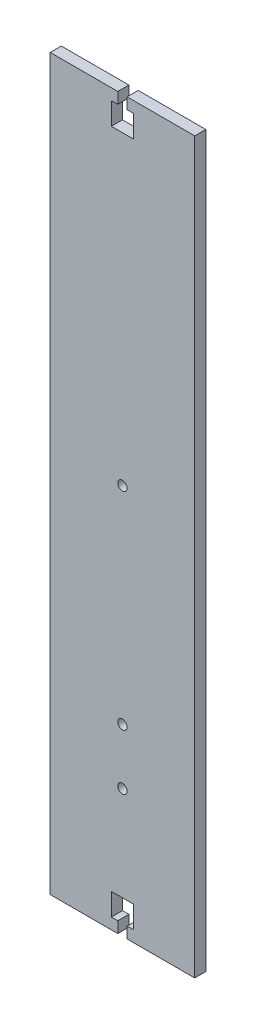
ISO-10303-21;
HEADER;
FILE_DESCRIPTION(('STEP AP214'),'2;1');
FILE_NAME('part.step','',(''),(''),'','','');
FILE_SCHEMA(('AUTOMOTIVE_DESIGN { 1 0 10303 214 1 1 1 1 }'));
ENDSEC;
DATA;
#1=APPLICATION_CONTEXT('core data for automotive mechanical design processes');
#2=APPLICATION_PROTOCOL_DEFINITION('international standard','automotive_design',2000,#1);
#3=PRODUCT_CONTEXT('',#1,'mechanical');
#4=PRODUCT('Part','Part','',(#3));
#5=PRODUCT_RELATED_PRODUCT_CATEGORY('part','',(#4));
#6=PRODUCT_DEFINITION_FORMATION('','',#4);
#7=PRODUCT_DEFINITION_CONTEXT('part definition',#1,'design');
#8=PRODUCT_DEFINITION('design','',#6,#7);
#9=PRODUCT_DEFINITION_SHAPE('','',#8);
#10=(LENGTH_UNIT() NAMED_UNIT(*) SI_UNIT(.MILLI.,.METRE.));
#11=(NAMED_UNIT(*) PLANE_ANGLE_UNIT() SI_UNIT($,.RADIAN.));
#12=(NAMED_UNIT(*) SI_UNIT($,.STERADIAN.) SOLID_ANGLE_UNIT());
#13=UNCERTAINTY_MEASURE_WITH_UNIT(LENGTH_MEASURE(1.E-05),#10,'distance_accuracy_value','');
#14=(GEOMETRIC_REPRESENTATION_CONTEXT(3) GLOBAL_UNCERTAINTY_ASSIGNED_CONTEXT((#13)) GLOBAL_UNIT_ASSIGNED_CONTEXT((#10,
#11,#12)) REPRESENTATION_CONTEXT('',''));
#15=CARTESIAN_POINT('',(0.,0.,0.));
#16=DIRECTION('',(0.,0.,1.));
#17=DIRECTION('',(1.,0.,0.));
#18=AXIS2_PLACEMENT_3D('',#15,#16,#17);
#19=CARTESIAN_POINT('',(32.498,-164.,5.));
#20=DIRECTION('',(0.,1.,0.));
#21=DIRECTION('',(0.,0.,1.));
#22=AXIS2_PLACEMENT_3D('',#19,#20,#21);
#23=PLANE('',#22);
#24=DIRECTION('',(1.,0.,0.));
#25=VECTOR('',#24,1.);
#26=CARTESIAN_POINT('',(32.498,-164.,0.));
#27=LINE('',#26,#25);
#28=CARTESIAN_POINT('',(-32.498,-164.,0.));
#29=VERTEX_POINT('',#28);
#30=CARTESIAN_POINT('',(-2.10000000000068,-164.,0.));
#31=VERTEX_POINT('',#30);
#32=EDGE_CURVE('E283',#29,#31,#27,.T.);
#33=ORIENTED_EDGE('',*,*,#32,.T.);
#34=DIRECTION('',(0.,0.,1.));
#35=VECTOR('',#34,1.);
#36=CARTESIAN_POINT('',(-2.10000000000068,-164.,-5.));
#37=LINE('',#36,#35);
#38=CARTESIAN_POINT('',(-2.10000000000068,-164.,5.));
#39=VERTEX_POINT('',#38);
#40=EDGE_CURVE('E192',#31,#39,#37,.T.);
#41=ORIENTED_EDGE('',*,*,#40,.T.);
#42=DIRECTION('',(1.,0.,0.));
#43=VECTOR('',#42,1.);
#44=CARTESIAN_POINT('',(32.498,-164.,5.));
#45=LINE('',#44,#43);
#46=CARTESIAN_POINT('',(-32.498,-164.,5.));
#47=VERTEX_POINT('',#46);
#48=EDGE_CURVE('E270',#47,#39,#45,.T.);
#49=ORIENTED_EDGE('',*,*,#48,.F.);
#50=DIRECTION('',(0.,0.,-1.));
#51=VECTOR('',#50,1.);
#52=CARTESIAN_POINT('',(-32.498,-164.,5.));
#53=LINE('',#52,#51);
#54=EDGE_CURVE('E299',#47,#29,#53,.T.);
#55=ORIENTED_EDGE('',*,*,#54,.T.);
#56=EDGE_LOOP('',(#33,#41,#49,#55));
#57=FACE_BOUND('',#56,.T.);
#58=ADVANCED_FACE('F37',(#57),#23,.F.);
#59=CARTESIAN_POINT('',(32.498,164.,5.));
#60=DIRECTION('',(0.,-1.,0.));
#61=DIRECTION('',(1.,0.,0.));
#62=AXIS2_PLACEMENT_3D('',#59,#60,#61);
#63=PLANE('',#62);
#64=DIRECTION('',(-1.,0.,0.));
#65=VECTOR('',#64,1.);
#66=CARTESIAN_POINT('',(32.498,164.,5.));
#67=LINE('',#66,#65);
#68=CARTESIAN_POINT('',(-2.09999999999999,164.,5.));
#69=VERTEX_POINT('',#68);
#70=CARTESIAN_POINT('',(-32.498,164.,5.));
#71=VERTEX_POINT('',#70);
#72=EDGE_CURVE('E275',#69,#71,#67,.T.);
#73=ORIENTED_EDGE('',*,*,#72,.F.);
#74=DIRECTION('',(0.,0.,1.));
#75=VECTOR('',#74,1.);
#76=CARTESIAN_POINT('',(-2.09999999999999,164.,-5.));
#77=LINE('',#76,#75);
#78=CARTESIAN_POINT('',(-2.09999999999999,164.,0.));
#79=VERTEX_POINT('',#78);
#80=EDGE_CURVE('E221',#79,#69,#77,.T.);
#81=ORIENTED_EDGE('',*,*,#80,.F.);
#82=DIRECTION('',(-1.,0.,0.));
#83=VECTOR('',#82,1.);
#84=CARTESIAN_POINT('',(32.498,164.,0.));
#85=LINE('',#84,#83);
#86=CARTESIAN_POINT('',(-32.498,164.,0.));
#87=VERTEX_POINT('',#86);
#88=EDGE_CURVE('E288',#79,#87,#85,.T.);
#89=ORIENTED_EDGE('',*,*,#88,.T.);
#90=DIRECTION('',(0.,0.,-1.));
#91=VECTOR('',#90,1.);
#92=CARTESIAN_POINT('',(-32.498,164.,5.));
#93=LINE('',#92,#91);
#94=EDGE_CURVE('E278',#71,#87,#93,.T.);
#95=ORIENTED_EDGE('',*,*,#94,.F.);
#96=EDGE_LOOP('',(#73,#81,#89,#95));
#97=FACE_BOUND('',#96,.T.);
#98=ADVANCED_FACE('F404',(#97),#63,.F.);
#99=CARTESIAN_POINT('',(-32.498,-164.,5.));
#100=DIRECTION('',(1.,0.,0.));
#101=DIRECTION('',(0.,0.,-1.));
#102=AXIS2_PLACEMENT_3D('',#99,#100,#101);
#103=PLANE('',#102);
#104=DIRECTION('',(0.,-1.,0.));
#105=VECTOR('',#104,1.);
#106=CARTESIAN_POINT('',(-32.498,-164.,0.));
#107=LINE('',#106,#105);
#108=EDGE_CURVE('E279',#87,#29,#107,.T.);
#109=ORIENTED_EDGE('',*,*,#108,.T.);
#110=ORIENTED_EDGE('',*,*,#54,.F.);
#111=DIRECTION('',(0.,-1.,0.));
#112=VECTOR('',#111,1.);
#113=CARTESIAN_POINT('',(-32.498,-164.,5.));
#114=LINE('',#113,#112);
#115=EDGE_CURVE('E265',#71,#47,#114,.T.);
#116=ORIENTED_EDGE('',*,*,#115,.F.);
#117=ORIENTED_EDGE('',*,*,#94,.T.);
#118=EDGE_LOOP('',(#109,#110,#116,#117));
#119=FACE_BOUND('',#118,.T.);
#120=ADVANCED_FACE('F39',(#119),#103,.F.);
#121=CARTESIAN_POINT('',(2.09999999999929,-164.,5.));
#122=VERTEX_POINT('',#121);
#123=CARTESIAN_POINT('',(32.498,-164.,5.));
#124=VERTEX_POINT('',#123);
#125=EDGE_CURVE('E268',#122,#124,#45,.T.);
#126=ORIENTED_EDGE('',*,*,#125,.F.);
#127=DIRECTION('',(0.,0.,1.));
#128=VECTOR('',#127,1.);
#129=CARTESIAN_POINT('',(2.09999999999929,-164.,-5.));
#130=LINE('',#129,#128);
#131=CARTESIAN_POINT('',(2.09999999999929,-164.,0.));
#132=VERTEX_POINT('',#131);
#133=EDGE_CURVE('E247',#132,#122,#130,.T.);
#134=ORIENTED_EDGE('',*,*,#133,.F.);
#135=CARTESIAN_POINT('',(32.498,-164.,0.));
#136=VERTEX_POINT('',#135);
#137=EDGE_CURVE('E282',#132,#136,#27,.T.);
#138=ORIENTED_EDGE('',*,*,#137,.T.);
#139=DIRECTION('',(0.,0.,-1.));
#140=VECTOR('',#139,1.);
#141=CARTESIAN_POINT('',(32.498,-164.,5.));
#142=LINE('',#141,#140);
#143=EDGE_CURVE('E296',#124,#136,#142,.T.);
#144=ORIENTED_EDGE('',*,*,#143,.F.);
#145=EDGE_LOOP('',(#126,#134,#138,#144));
#146=FACE_BOUND('',#145,.T.);
#147=ADVANCED_FACE('F371',(#146),#23,.F.);
#148=CARTESIAN_POINT('',(32.498,-164.,5.));
#149=DIRECTION('',(-1.,0.,0.));
#150=DIRECTION('',(0.,-1.,0.));
#151=AXIS2_PLACEMENT_3D('',#148,#149,#150);
#152=PLANE('',#151);
#153=DIRECTION('',(0.,1.,0.));
#154=VECTOR('',#153,1.);
#155=CARTESIAN_POINT('',(32.498,-164.,0.));
#156=LINE('',#155,#154);
#157=CARTESIAN_POINT('',(32.498,164.,0.));
#158=VERTEX_POINT('',#157);
#159=EDGE_CURVE('E286',#136,#158,#156,.T.);
#160=ORIENTED_EDGE('',*,*,#159,.T.);
#161=DIRECTION('',(0.,0.,-1.));
#162=VECTOR('',#161,1.);
#163=CARTESIAN_POINT('',(32.498,164.,5.));
#164=LINE('',#163,#162);
#165=CARTESIAN_POINT('',(32.498,164.,5.));
#166=VERTEX_POINT('',#165);
#167=EDGE_CURVE('E293',#166,#158,#164,.T.);
#168=ORIENTED_EDGE('',*,*,#167,.F.);
#169=DIRECTION('',(0.,1.,0.));
#170=VECTOR('',#169,1.);
#171=CARTESIAN_POINT('',(32.498,-164.,5.));
#172=LINE('',#171,#170);
#173=EDGE_CURVE('E273',#124,#166,#172,.T.);
#174=ORIENTED_EDGE('',*,*,#173,.F.);
#175=ORIENTED_EDGE('',*,*,#143,.T.);
#176=EDGE_LOOP('',(#160,#168,#174,#175));
#177=FACE_BOUND('',#176,.T.);
#178=ADVANCED_FACE('F365',(#177),#152,.F.);
#179=CARTESIAN_POINT('',(2.1,164.,0.));
#180=VERTEX_POINT('',#179);
#181=EDGE_CURVE('E269',#158,#180,#85,.T.);
#182=ORIENTED_EDGE('',*,*,#181,.T.);
#183=DIRECTION('',(0.,0.,1.));
#184=VECTOR('',#183,1.);
#185=CARTESIAN_POINT('',(2.1,164.,-5.));
#186=LINE('',#185,#184);
#187=CARTESIAN_POINT('',(2.1,164.,5.));
#188=VERTEX_POINT('',#187);
#189=EDGE_CURVE('E223',#180,#188,#186,.T.);
#190=ORIENTED_EDGE('',*,*,#189,.T.);
#191=EDGE_CURVE('E276',#166,#188,#67,.T.);
#192=ORIENTED_EDGE('',*,*,#191,.F.);
#193=ORIENTED_EDGE('',*,*,#167,.T.);
#194=EDGE_LOOP('',(#182,#190,#192,#193));
#195=FACE_BOUND('',#194,.T.);
#196=ADVANCED_FACE('F360',(#195),#63,.F.);
#197=CARTESIAN_POINT('',(0.,0.,5.));
#198=DIRECTION('',(0.,0.,1.));
#199=DIRECTION('',(1.,0.,0.));
#200=AXIS2_PLACEMENT_3D('',#197,#198,#199);
#201=PLANE('',#200);
#202=CARTESIAN_POINT('',(0.,11.5000000000002,5.));
#203=DIRECTION('',(0.,0.,1.));
#204=DIRECTION('',(1.,0.,0.));
#205=AXIS2_PLACEMENT_3D('',#202,#203,#204);
#206=CIRCLE('',#205,2.1);
#207=CARTESIAN_POINT('',(2.10000000000001,11.5000000000002,5.));
#208=VERTEX_POINT('',#207);
#209=EDGE_CURVE('E604',#208,#208,#206,.T.);
#210=ORIENTED_EDGE('',*,*,#209,.F.);
#211=EDGE_LOOP('',(#210));
#212=FACE_BOUND('',#211,.T.);
#213=CARTESIAN_POINT('',(0.,-106.5,5.));
#214=DIRECTION('',(0.,0.,1.));
#215=DIRECTION('',(1.,0.,0.));
#216=AXIS2_PLACEMENT_3D('',#213,#214,#215);
#217=CIRCLE('',#216,2.1);
#218=CARTESIAN_POINT('',(2.1,-106.5,5.));
#219=VERTEX_POINT('',#218);
#220=EDGE_CURVE('E600',#219,#219,#217,.T.);
#221=ORIENTED_EDGE('',*,*,#220,.F.);
#222=EDGE_LOOP('',(#221));
#223=FACE_BOUND('',#222,.T.);
#224=DIRECTION('',(0.,-1.,0.));
#225=VECTOR('',#224,1.);
#226=CARTESIAN_POINT('',(-2.09999999999999,164.,5.));
#227=LINE('',#226,#225);
#228=CARTESIAN_POINT('',(-2.09999999999999,159.,5.));
#229=VERTEX_POINT('',#228);
#230=EDGE_CURVE('E200',#69,#229,#227,.T.);
#231=ORIENTED_EDGE('',*,*,#230,.F.);
#232=ORIENTED_EDGE('',*,*,#72,.T.);
#233=ORIENTED_EDGE('',*,*,#115,.T.);
#234=ORIENTED_EDGE('',*,*,#48,.T.);
#235=DIRECTION('',(0.,-1.,0.));
#236=VECTOR('',#235,1.);
#237=CARTESIAN_POINT('',(-2.10000000000068,-164.,5.));
#238=LINE('',#237,#236);
#239=CARTESIAN_POINT('',(-2.10000000000066,-159.,5.));
#240=VERTEX_POINT('',#239);
#241=EDGE_CURVE('E245',#240,#39,#238,.T.);
#242=ORIENTED_EDGE('',*,*,#241,.F.);
#243=DIRECTION('',(1.,0.,0.));
#244=VECTOR('',#243,1.);
#245=CARTESIAN_POINT('',(-2.10000000000066,-159.,5.));
#246=LINE('',#245,#244);
#247=CARTESIAN_POINT('',(-5.00000000000066,-159.,5.));
#248=VERTEX_POINT('',#247);
#249=EDGE_CURVE('E242',#248,#240,#246,.T.);
#250=ORIENTED_EDGE('',*,*,#249,.F.);
#251=DIRECTION('',(0.,-1.,0.));
#252=VECTOR('',#251,1.);
#253=CARTESIAN_POINT('',(-5.00000000000066,-159.,5.));
#254=LINE('',#253,#252);
#255=CARTESIAN_POINT('',(-5.00000000000063,-149.,5.));
#256=VERTEX_POINT('',#255);
#257=EDGE_CURVE('E239',#256,#248,#254,.T.);
#258=ORIENTED_EDGE('',*,*,#257,.F.);
#259=DIRECTION('',(-1.,0.,0.));
#260=VECTOR('',#259,1.);
#261=CARTESIAN_POINT('',(4.99999999999935,-149.,5.));
#262=LINE('',#261,#260);
#263=CARTESIAN_POINT('',(4.99999999999935,-149.,5.));
#264=VERTEX_POINT('',#263);
#265=EDGE_CURVE('E236',#264,#256,#262,.T.);
#266=ORIENTED_EDGE('',*,*,#265,.F.);
#267=DIRECTION('',(0.,1.,0.));
#268=VECTOR('',#267,1.);
#269=CARTESIAN_POINT('',(4.99999999999931,-159.,5.));
#270=LINE('',#269,#268);
#271=CARTESIAN_POINT('',(4.99999999999931,-159.,5.));
#272=VERTEX_POINT('',#271);
#273=EDGE_CURVE('E233',#272,#264,#270,.T.);
#274=ORIENTED_EDGE('',*,*,#273,.F.);
#275=DIRECTION('',(1.,0.,0.));
#276=VECTOR('',#275,1.);
#277=CARTESIAN_POINT('',(2.09999999999931,-159.,5.));
#278=LINE('',#277,#276);
#279=CARTESIAN_POINT('',(2.09999999999931,-159.,5.));
#280=VERTEX_POINT('',#279);
#281=EDGE_CURVE('E229',#280,#272,#278,.T.);
#282=ORIENTED_EDGE('',*,*,#281,.F.);
#283=DIRECTION('',(0.,1.,0.));
#284=VECTOR('',#283,1.);
#285=CARTESIAN_POINT('',(2.09999999999929,-164.,5.));
#286=LINE('',#285,#284);
#287=EDGE_CURVE('E227',#122,#280,#286,.T.);
#288=ORIENTED_EDGE('',*,*,#287,.F.);
#289=ORIENTED_EDGE('',*,*,#125,.T.);
#290=ORIENTED_EDGE('',*,*,#173,.T.);
#291=ORIENTED_EDGE('',*,*,#191,.T.);
#292=DIRECTION('',(0.,1.,0.));
#293=VECTOR('',#292,1.);
#294=CARTESIAN_POINT('',(2.1,164.,5.));
#295=LINE('',#294,#293);
#296=CARTESIAN_POINT('',(2.1,159.,5.));
#297=VERTEX_POINT('',#296);
#298=EDGE_CURVE('E198',#297,#188,#295,.T.);
#299=ORIENTED_EDGE('',*,*,#298,.F.);
#300=DIRECTION('',(-1.,0.,0.));
#301=VECTOR('',#300,1.);
#302=CARTESIAN_POINT('',(2.1,159.,5.));
#303=LINE('',#302,#301);
#304=CARTESIAN_POINT('',(5.,159.,5.));
#305=VERTEX_POINT('',#304);
#306=EDGE_CURVE('E176',#305,#297,#303,.T.);
#307=ORIENTED_EDGE('',*,*,#306,.F.);
#308=DIRECTION('',(0.,1.,0.));
#309=VECTOR('',#308,1.);
#310=CARTESIAN_POINT('',(5.,159.,5.));
#311=LINE('',#310,#309);
#312=CARTESIAN_POINT('',(5.,149.,5.));
#313=VERTEX_POINT('',#312);
#314=EDGE_CURVE('E185',#313,#305,#311,.T.);
#315=ORIENTED_EDGE('',*,*,#314,.F.);
#316=DIRECTION('',(1.,0.,0.));
#317=VECTOR('',#316,1.);
#318=CARTESIAN_POINT('',(5.,149.,5.));
#319=LINE('',#318,#317);
#320=CARTESIAN_POINT('',(-5.,149.,5.));
#321=VERTEX_POINT('',#320);
#322=EDGE_CURVE('E182',#321,#313,#319,.T.);
#323=ORIENTED_EDGE('',*,*,#322,.F.);
#324=DIRECTION('',(0.,-1.,0.));
#325=VECTOR('',#324,1.);
#326=CARTESIAN_POINT('',(-4.99999999999999,159.,5.));
#327=LINE('',#326,#325);
#328=CARTESIAN_POINT('',(-4.99999999999999,159.,5.));
#329=VERTEX_POINT('',#328);
#330=EDGE_CURVE('E209',#329,#321,#327,.T.);
#331=ORIENTED_EDGE('',*,*,#330,.F.);
#332=DIRECTION('',(-1.,0.,0.));
#333=VECTOR('',#332,1.);
#334=CARTESIAN_POINT('',(-2.09999999999999,159.,5.));
#335=LINE('',#334,#333);
#336=EDGE_CURVE('E206',#229,#329,#335,.T.);
#337=ORIENTED_EDGE('',*,*,#336,.F.);
#338=EDGE_LOOP('',(#231,#232,#233,#234,#242,#250,#258,#266,#274,#282,#288,#289,#290,#291,#299,
#307,#315,#323,#331,#337));
#339=FACE_BOUND('',#338,.T.);
#340=CARTESIAN_POINT('',(0.,-81.4999999999999,5.));
#341=DIRECTION('',(0.,0.,1.));
#342=DIRECTION('',(1.,0.,0.));
#343=AXIS2_PLACEMENT_3D('',#340,#341,#342);
#344=CIRCLE('',#343,2.1);
#345=CARTESIAN_POINT('',(2.10000000000001,-81.4999999999999,5.));
#346=VERTEX_POINT('',#345);
#347=EDGE_CURVE('E214',#346,#346,#344,.T.);
#348=ORIENTED_EDGE('',*,*,#347,.F.);
#349=EDGE_LOOP('',(#348));
#350=FACE_BOUND('',#349,.T.);
#351=ADVANCED_FACE('F195',(#212,#223,#339,#350),#201,.T.);
#352=CARTESIAN_POINT('',(0.,0.,0.));
#353=DIRECTION('',(0.,0.,1.));
#354=DIRECTION('',(1.,0.,0.));
#355=AXIS2_PLACEMENT_3D('',#352,#353,#354);
#356=PLANE('',#355);
#357=CARTESIAN_POINT('',(0.,11.5000000000002,0.));
#358=DIRECTION('',(0.,0.,1.));
#359=DIRECTION('',(1.,0.,0.));
#360=AXIS2_PLACEMENT_3D('',#357,#358,#359);
#361=CIRCLE('',#360,2.1);
#362=CARTESIAN_POINT('',(2.10000000000001,11.5000000000002,0.));
#363=VERTEX_POINT('',#362);
#364=EDGE_CURVE('E597',#363,#363,#361,.T.);
#365=ORIENTED_EDGE('',*,*,#364,.T.);
#366=EDGE_LOOP('',(#365));
#367=FACE_BOUND('',#366,.T.);
#368=CARTESIAN_POINT('',(0.,-106.5,0.));
#369=DIRECTION('',(0.,0.,1.));
#370=DIRECTION('',(1.,0.,0.));
#371=AXIS2_PLACEMENT_3D('',#368,#369,#370);
#372=CIRCLE('',#371,2.1);
#373=CARTESIAN_POINT('',(2.1,-106.5,0.));
#374=VERTEX_POINT('',#373);
#375=EDGE_CURVE('E230',#374,#374,#372,.T.);
#376=ORIENTED_EDGE('',*,*,#375,.T.);
#377=EDGE_LOOP('',(#376));
#378=FACE_BOUND('',#377,.T.);
#379=ORIENTED_EDGE('',*,*,#88,.F.);
#380=DIRECTION('',(0.,-1.,0.));
#381=VECTOR('',#380,1.);
#382=CARTESIAN_POINT('',(-2.10000000000009,0.,0.));
#383=LINE('',#382,#381);
#384=CARTESIAN_POINT('',(-2.09999999999999,159.,0.));
#385=VERTEX_POINT('',#384);
#386=EDGE_CURVE('E11',#79,#385,#383,.T.);
#387=ORIENTED_EDGE('',*,*,#386,.T.);
#388=DIRECTION('',(-1.,0.,0.));
#389=VECTOR('',#388,1.);
#390=CARTESIAN_POINT('',(0.,159.,0.));
#391=LINE('',#390,#389);
#392=CARTESIAN_POINT('',(-4.99999999999999,159.,0.));
#393=VERTEX_POINT('',#392);
#394=EDGE_CURVE('E45',#385,#393,#391,.T.);
#395=ORIENTED_EDGE('',*,*,#394,.T.);
#396=DIRECTION('',(0.,-1.,0.));
#397=VECTOR('',#396,1.);
#398=CARTESIAN_POINT('',(-5.00000000000011,0.,0.));
#399=LINE('',#398,#397);
#400=CARTESIAN_POINT('',(-5.,149.,0.));
#401=VERTEX_POINT('',#400);
#402=EDGE_CURVE('E334',#393,#401,#399,.T.);
#403=ORIENTED_EDGE('',*,*,#402,.T.);
#404=DIRECTION('',(1.,0.,0.));
#405=VECTOR('',#404,1.);
#406=CARTESIAN_POINT('',(0.,149.,0.));
#407=LINE('',#406,#405);
#408=CARTESIAN_POINT('',(5.,149.,0.));
#409=VERTEX_POINT('',#408);
#410=EDGE_CURVE('E331',#401,#409,#407,.T.);
#411=ORIENTED_EDGE('',*,*,#410,.T.);
#412=DIRECTION('',(0.,1.,0.));
#413=VECTOR('',#412,1.);
#414=CARTESIAN_POINT('',(5.00000000000001,0.,0.));
#415=LINE('',#414,#413);
#416=CARTESIAN_POINT('',(5.,159.,0.));
#417=VERTEX_POINT('',#416);
#418=EDGE_CURVE('E329',#409,#417,#415,.T.);
#419=ORIENTED_EDGE('',*,*,#418,.T.);
#420=DIRECTION('',(-1.,0.,0.));
#421=VECTOR('',#420,1.);
#422=CARTESIAN_POINT('',(0.,159.,0.));
#423=LINE('',#422,#421);
#424=CARTESIAN_POINT('',(2.1,159.,0.));
#425=VERTEX_POINT('',#424);
#426=EDGE_CURVE('E179',#417,#425,#423,.T.);
#427=ORIENTED_EDGE('',*,*,#426,.T.);
#428=DIRECTION('',(0.,1.,0.));
#429=VECTOR('',#428,1.);
#430=CARTESIAN_POINT('',(2.09999999999999,0.,0.));
#431=LINE('',#430,#429);
#432=EDGE_CURVE('E326',#425,#180,#431,.T.);
#433=ORIENTED_EDGE('',*,*,#432,.T.);
#434=ORIENTED_EDGE('',*,*,#181,.F.);
#435=ORIENTED_EDGE('',*,*,#159,.F.);
#436=ORIENTED_EDGE('',*,*,#137,.F.);
#437=DIRECTION('',(0.,1.,0.));
#438=VECTOR('',#437,1.);
#439=CARTESIAN_POINT('',(2.09999999999973,0.,0.));
#440=LINE('',#439,#438);
#441=CARTESIAN_POINT('',(2.09999999999931,-159.,0.));
#442=VERTEX_POINT('',#441);
#443=EDGE_CURVE('E302',#132,#442,#440,.T.);
#444=ORIENTED_EDGE('',*,*,#443,.T.);
#445=DIRECTION('',(1.,0.,0.));
#446=VECTOR('',#445,1.);
#447=CARTESIAN_POINT('',(0.,-159.,0.));
#448=LINE('',#447,#446);
#449=CARTESIAN_POINT('',(4.99999999999931,-159.,0.));
#450=VERTEX_POINT('',#449);
#451=EDGE_CURVE('E307',#442,#450,#448,.T.);
#452=ORIENTED_EDGE('',*,*,#451,.T.);
#453=DIRECTION('',(0.,1.,0.));
#454=VECTOR('',#453,1.);
#455=CARTESIAN_POINT('',(4.99999999999998,0.,0.));
#456=LINE('',#455,#454);
#457=CARTESIAN_POINT('',(4.99999999999935,-149.,0.));
#458=VERTEX_POINT('',#457);
#459=EDGE_CURVE('E310',#450,#458,#456,.T.);
#460=ORIENTED_EDGE('',*,*,#459,.T.);
#461=DIRECTION('',(-1.,0.,0.));
#462=VECTOR('',#461,1.);
#463=CARTESIAN_POINT('',(-8.27116153345744E-13,-149.,0.));
#464=LINE('',#463,#462);
#465=CARTESIAN_POINT('',(-5.00000000000063,-149.,0.));
#466=VERTEX_POINT('',#465);
#467=EDGE_CURVE('E313',#458,#466,#464,.T.);
#468=ORIENTED_EDGE('',*,*,#467,.T.);
#469=DIRECTION('',(0.,-1.,0.));
#470=VECTOR('',#469,1.);
#471=CARTESIAN_POINT('',(-5.00000000000013,0.,0.));
#472=LINE('',#471,#470);
#473=CARTESIAN_POINT('',(-5.00000000000066,-159.,0.));
#474=VERTEX_POINT('',#473);
#475=EDGE_CURVE('E316',#466,#474,#472,.T.);
#476=ORIENTED_EDGE('',*,*,#475,.T.);
#477=DIRECTION('',(1.,0.,0.));
#478=VECTOR('',#477,1.);
#479=CARTESIAN_POINT('',(0.,-159.,0.));
#480=LINE('',#479,#478);
#481=CARTESIAN_POINT('',(-2.10000000000066,-159.,0.));
#482=VERTEX_POINT('',#481);
#483=EDGE_CURVE('E319',#474,#482,#480,.T.);
#484=ORIENTED_EDGE('',*,*,#483,.T.);
#485=DIRECTION('',(0.,-1.,0.));
#486=VECTOR('',#485,1.);
#487=CARTESIAN_POINT('',(-2.1000000000001,0.,0.));
#488=LINE('',#487,#486);
#489=EDGE_CURVE('E322',#482,#31,#488,.T.);
#490=ORIENTED_EDGE('',*,*,#489,.T.);
#491=ORIENTED_EDGE('',*,*,#32,.F.);
#492=ORIENTED_EDGE('',*,*,#108,.F.);
#493=EDGE_LOOP('',(#379,#387,#395,#403,#411,#419,#427,#433,#434,#435,#436,#444,#452,#460,#468,
#476,#484,#490,#491,#492));
#494=FACE_BOUND('',#493,.T.);
#495=CARTESIAN_POINT('',(0.,-81.4999999999999,0.));
#496=DIRECTION('',(0.,0.,1.));
#497=DIRECTION('',(1.,0.,0.));
#498=AXIS2_PLACEMENT_3D('',#495,#496,#497);
#499=CIRCLE('',#498,2.1);
#500=CARTESIAN_POINT('',(2.10000000000001,-81.4999999999999,0.));
#501=VERTEX_POINT('',#500);
#502=EDGE_CURVE('E264',#501,#501,#499,.T.);
#503=ORIENTED_EDGE('',*,*,#502,.T.);
#504=EDGE_LOOP('',(#503));
#505=FACE_BOUND('',#504,.T.);
#506=ADVANCED_FACE('F339',(#367,#378,#494,#505),#356,.F.);
#507=CARTESIAN_POINT('',(0.,-81.4999999999999,-5.));
#508=DIRECTION('',(0.,0.,1.));
#509=DIRECTION('',(1.,0.,0.));
#510=AXIS2_PLACEMENT_3D('',#507,#508,#509);
#511=CYLINDRICAL_SURFACE('',#510,2.1);
#512=ORIENTED_EDGE('',*,*,#347,.T.);
#513=EDGE_LOOP('',(#512));
#514=FACE_BOUND('',#513,.T.);
#515=ORIENTED_EDGE('',*,*,#502,.F.);
#516=EDGE_LOOP('',(#515));
#517=FACE_BOUND('',#516,.T.);
#518=ADVANCED_FACE('F442',(#514,#517),#511,.F.);
#519=CARTESIAN_POINT('',(-2.10000000000068,-164.,-5.));
#520=DIRECTION('',(-1.,0.,0.));
#521=DIRECTION('',(0.,-1.,0.));
#522=AXIS2_PLACEMENT_3D('',#519,#520,#521);
#523=PLANE('',#522);
#524=DIRECTION('',(0.,0.,1.));
#525=VECTOR('',#524,1.);
#526=CARTESIAN_POINT('',(-2.10000000000066,-159.,-5.));
#527=LINE('',#526,#525);
#528=EDGE_CURVE('E250',#482,#240,#527,.T.);
#529=ORIENTED_EDGE('',*,*,#528,.T.);
#530=ORIENTED_EDGE('',*,*,#241,.T.);
#531=ORIENTED_EDGE('',*,*,#40,.F.);
#532=ORIENTED_EDGE('',*,*,#489,.F.);
#533=EDGE_LOOP('',(#529,#530,#531,#532));
#534=FACE_BOUND('',#533,.T.);
#535=ADVANCED_FACE('F396',(#534),#523,.F.);
#536=CARTESIAN_POINT('',(-2.10000000000066,-159.,-5.));
#537=DIRECTION('',(0.,-1.,0.));
#538=DIRECTION('',(0.,0.,-1.));
#539=AXIS2_PLACEMENT_3D('',#536,#537,#538);
#540=PLANE('',#539);
#541=DIRECTION('',(0.,0.,1.));
#542=VECTOR('',#541,1.);
#543=CARTESIAN_POINT('',(-5.00000000000066,-159.,-5.));
#544=LINE('',#543,#542);
#545=EDGE_CURVE('E252',#474,#248,#544,.T.);
#546=ORIENTED_EDGE('',*,*,#545,.T.);
#547=ORIENTED_EDGE('',*,*,#249,.T.);
#548=ORIENTED_EDGE('',*,*,#528,.F.);
#549=ORIENTED_EDGE('',*,*,#483,.F.);
#550=EDGE_LOOP('',(#546,#547,#548,#549));
#551=FACE_BOUND('',#550,.T.);
#552=ADVANCED_FACE('F393',(#551),#540,.F.);
#553=CARTESIAN_POINT('',(-5.00000000000066,-159.,-5.));
#554=DIRECTION('',(-1.,0.,0.));
#555=DIRECTION('',(0.,-1.,0.));
#556=AXIS2_PLACEMENT_3D('',#553,#554,#555);
#557=PLANE('',#556);
#558=DIRECTION('',(0.,0.,1.));
#559=VECTOR('',#558,1.);
#560=CARTESIAN_POINT('',(-5.00000000000063,-149.,-5.));
#561=LINE('',#560,#559);
#562=EDGE_CURVE('E254',#466,#256,#561,.T.);
#563=ORIENTED_EDGE('',*,*,#562,.T.);
#564=ORIENTED_EDGE('',*,*,#257,.T.);
#565=ORIENTED_EDGE('',*,*,#545,.F.);
#566=ORIENTED_EDGE('',*,*,#475,.F.);
#567=EDGE_LOOP('',(#563,#564,#565,#566));
#568=FACE_BOUND('',#567,.T.);
#569=ADVANCED_FACE('F388',(#568),#557,.F.);
#570=CARTESIAN_POINT('',(4.99999999999935,-149.,-5.));
#571=DIRECTION('',(0.,1.,0.));
#572=DIRECTION('',(-1.,0.,0.));
#573=AXIS2_PLACEMENT_3D('',#570,#571,#572);
#574=PLANE('',#573);
#575=DIRECTION('',(0.,0.,1.));
#576=VECTOR('',#575,1.);
#577=CARTESIAN_POINT('',(4.99999999999935,-149.,-5.));
#578=LINE('',#577,#576);
#579=EDGE_CURVE('E256',#458,#264,#578,.T.);
#580=ORIENTED_EDGE('',*,*,#579,.T.);
#581=ORIENTED_EDGE('',*,*,#265,.T.);
#582=ORIENTED_EDGE('',*,*,#562,.F.);
#583=ORIENTED_EDGE('',*,*,#467,.F.);
#584=EDGE_LOOP('',(#580,#581,#582,#583));
#585=FACE_BOUND('',#584,.T.);
#586=ADVANCED_FACE('F384',(#585),#574,.F.);
#587=CARTESIAN_POINT('',(4.99999999999931,-159.,-5.));
#588=DIRECTION('',(1.,0.,0.));
#589=DIRECTION('',(0.,1.,0.));
#590=AXIS2_PLACEMENT_3D('',#587,#588,#589);
#591=PLANE('',#590);
#592=DIRECTION('',(0.,0.,1.));
#593=VECTOR('',#592,1.);
#594=CARTESIAN_POINT('',(4.99999999999931,-159.,-5.));
#595=LINE('',#594,#593);
#596=EDGE_CURVE('E258',#450,#272,#595,.T.);
#597=ORIENTED_EDGE('',*,*,#596,.T.);
#598=ORIENTED_EDGE('',*,*,#273,.T.);
#599=ORIENTED_EDGE('',*,*,#579,.F.);
#600=ORIENTED_EDGE('',*,*,#459,.F.);
#601=EDGE_LOOP('',(#597,#598,#599,#600));
#602=FACE_BOUND('',#601,.T.);
#603=ADVANCED_FACE('F382',(#602),#591,.F.);
#604=CARTESIAN_POINT('',(2.09999999999931,-159.,-5.));
#605=DIRECTION('',(0.,-1.,0.));
#606=DIRECTION('',(0.,0.,-1.));
#607=AXIS2_PLACEMENT_3D('',#604,#605,#606);
#608=PLANE('',#607);
#609=DIRECTION('',(0.,0.,1.));
#610=VECTOR('',#609,1.);
#611=CARTESIAN_POINT('',(2.09999999999931,-159.,-5.));
#612=LINE('',#611,#610);
#613=EDGE_CURVE('E60',#442,#280,#612,.T.);
#614=ORIENTED_EDGE('',*,*,#613,.T.);
#615=ORIENTED_EDGE('',*,*,#281,.T.);
#616=ORIENTED_EDGE('',*,*,#596,.F.);
#617=ORIENTED_EDGE('',*,*,#451,.F.);
#618=EDGE_LOOP('',(#614,#615,#616,#617));
#619=FACE_BOUND('',#618,.T.);
#620=ADVANCED_FACE('F379',(#619),#608,.F.);
#621=CARTESIAN_POINT('',(2.09999999999929,-164.,-5.));
#622=DIRECTION('',(1.,0.,0.));
#623=DIRECTION('',(0.,1.,0.));
#624=AXIS2_PLACEMENT_3D('',#621,#622,#623);
#625=PLANE('',#624);
#626=ORIENTED_EDGE('',*,*,#133,.T.);
#627=ORIENTED_EDGE('',*,*,#287,.T.);
#628=ORIENTED_EDGE('',*,*,#613,.F.);
#629=ORIENTED_EDGE('',*,*,#443,.F.);
#630=EDGE_LOOP('',(#626,#627,#628,#629));
#631=FACE_BOUND('',#630,.T.);
#632=ADVANCED_FACE('F373',(#631),#625,.F.);
#633=CARTESIAN_POINT('',(5.,159.,-5.));
#634=DIRECTION('',(1.,0.,0.));
#635=DIRECTION('',(0.,1.,0.));
#636=AXIS2_PLACEMENT_3D('',#633,#634,#635);
#637=PLANE('',#636);
#638=DIRECTION('',(0.,0.,1.));
#639=VECTOR('',#638,1.);
#640=CARTESIAN_POINT('',(5.,149.,-5.));
#641=LINE('',#640,#639);
#642=EDGE_CURVE('E188',#409,#313,#641,.T.);
#643=ORIENTED_EDGE('',*,*,#642,.T.);
#644=ORIENTED_EDGE('',*,*,#314,.T.);
#645=DIRECTION('',(0.,0.,1.));
#646=VECTOR('',#645,1.);
#647=CARTESIAN_POINT('',(5.,159.,-5.));
#648=LINE('',#647,#646);
#649=EDGE_CURVE('E172',#417,#305,#648,.T.);
#650=ORIENTED_EDGE('',*,*,#649,.F.);
#651=ORIENTED_EDGE('',*,*,#418,.F.);
#652=EDGE_LOOP('',(#643,#644,#650,#651));
#653=FACE_BOUND('',#652,.T.);
#654=ADVANCED_FACE('F186',(#653),#637,.F.);
#655=CARTESIAN_POINT('',(5.,149.,-5.));
#656=DIRECTION('',(0.,-1.,0.));
#657=DIRECTION('',(0.,0.,-1.));
#658=AXIS2_PLACEMENT_3D('',#655,#656,#657);
#659=PLANE('',#658);
#660=DIRECTION('',(0.,0.,1.));
#661=VECTOR('',#660,1.);
#662=CARTESIAN_POINT('',(-5.,149.,-5.));
#663=LINE('',#662,#661);
#664=EDGE_CURVE('E215',#401,#321,#663,.T.);
#665=ORIENTED_EDGE('',*,*,#664,.T.);
#666=ORIENTED_EDGE('',*,*,#322,.T.);
#667=ORIENTED_EDGE('',*,*,#642,.F.);
#668=ORIENTED_EDGE('',*,*,#410,.F.);
#669=EDGE_LOOP('',(#665,#666,#667,#668));
#670=FACE_BOUND('',#669,.T.);
#671=ADVANCED_FACE('F355',(#670),#659,.F.);
#672=CARTESIAN_POINT('',(-4.99999999999999,159.,-5.));
#673=DIRECTION('',(-1.,0.,0.));
#674=DIRECTION('',(0.,-1.,0.));
#675=AXIS2_PLACEMENT_3D('',#672,#673,#674);
#676=PLANE('',#675);
#677=DIRECTION('',(0.,0.,1.));
#678=VECTOR('',#677,1.);
#679=CARTESIAN_POINT('',(-4.99999999999999,159.,-5.));
#680=LINE('',#679,#678);
#681=EDGE_CURVE('E217',#393,#329,#680,.T.);
#682=ORIENTED_EDGE('',*,*,#681,.T.);
#683=ORIENTED_EDGE('',*,*,#330,.T.);
#684=ORIENTED_EDGE('',*,*,#664,.F.);
#685=ORIENTED_EDGE('',*,*,#402,.F.);
#686=EDGE_LOOP('',(#682,#683,#684,#685));
#687=FACE_BOUND('',#686,.T.);
#688=ADVANCED_FACE('F353',(#687),#676,.F.);
#689=CARTESIAN_POINT('',(-2.09999999999999,159.,-5.));
#690=DIRECTION('',(0.,1.,0.));
#691=DIRECTION('',(0.,0.,1.));
#692=AXIS2_PLACEMENT_3D('',#689,#690,#691);
#693=PLANE('',#692);
#694=DIRECTION('',(0.,0.,1.));
#695=VECTOR('',#694,1.);
#696=CARTESIAN_POINT('',(-2.09999999999999,159.,-5.));
#697=LINE('',#696,#695);
#698=EDGE_CURVE('E219',#385,#229,#697,.T.);
#699=ORIENTED_EDGE('',*,*,#698,.T.);
#700=ORIENTED_EDGE('',*,*,#336,.T.);
#701=ORIENTED_EDGE('',*,*,#681,.F.);
#702=ORIENTED_EDGE('',*,*,#394,.F.);
#703=EDGE_LOOP('',(#699,#700,#701,#702));
#704=FACE_BOUND('',#703,.T.);
#705=ADVANCED_FACE('F344',(#704),#693,.F.);
#706=CARTESIAN_POINT('',(-2.09999999999999,164.,-5.));
#707=DIRECTION('',(-1.,0.,0.));
#708=DIRECTION('',(0.,-1.,0.));
#709=AXIS2_PLACEMENT_3D('',#706,#707,#708);
#710=PLANE('',#709);
#711=ORIENTED_EDGE('',*,*,#80,.T.);
#712=ORIENTED_EDGE('',*,*,#230,.T.);
#713=ORIENTED_EDGE('',*,*,#698,.F.);
#714=ORIENTED_EDGE('',*,*,#386,.F.);
#715=EDGE_LOOP('',(#711,#712,#713,#714));
#716=FACE_BOUND('',#715,.T.);
#717=ADVANCED_FACE('F346',(#716),#710,.F.);
#718=CARTESIAN_POINT('',(2.1,164.,-5.));
#719=DIRECTION('',(1.,0.,0.));
#720=DIRECTION('',(0.,1.,0.));
#721=AXIS2_PLACEMENT_3D('',#718,#719,#720);
#722=PLANE('',#721);
#723=DIRECTION('',(0.,0.,1.));
#724=VECTOR('',#723,1.);
#725=CARTESIAN_POINT('',(2.1,159.,-5.));
#726=LINE('',#725,#724);
#727=EDGE_CURVE('E52',#425,#297,#726,.T.);
#728=ORIENTED_EDGE('',*,*,#727,.T.);
#729=ORIENTED_EDGE('',*,*,#298,.T.);
#730=ORIENTED_EDGE('',*,*,#189,.F.);
#731=ORIENTED_EDGE('',*,*,#432,.F.);
#732=EDGE_LOOP('',(#728,#729,#730,#731));
#733=FACE_BOUND('',#732,.T.);
#734=ADVANCED_FACE('F544',(#733),#722,.F.);
#735=CARTESIAN_POINT('',(2.1,159.,-5.));
#736=DIRECTION('',(0.,1.,0.));
#737=DIRECTION('',(0.,0.,1.));
#738=AXIS2_PLACEMENT_3D('',#735,#736,#737);
#739=PLANE('',#738);
#740=ORIENTED_EDGE('',*,*,#649,.T.);
#741=ORIENTED_EDGE('',*,*,#306,.T.);
#742=ORIENTED_EDGE('',*,*,#727,.F.);
#743=ORIENTED_EDGE('',*,*,#426,.F.);
#744=EDGE_LOOP('',(#740,#741,#742,#743));
#745=FACE_BOUND('',#744,.T.);
#746=ADVANCED_FACE('F174',(#745),#739,.F.);
#747=CARTESIAN_POINT('',(0.,-106.5,0.));
#748=DIRECTION('',(0.,0.,1.));
#749=DIRECTION('',(1.,0.,0.));
#750=AXIS2_PLACEMENT_3D('',#747,#748,#749);
#751=CYLINDRICAL_SURFACE('',#750,2.1);
#752=ORIENTED_EDGE('',*,*,#375,.F.);
#753=EDGE_LOOP('',(#752));
#754=FACE_BOUND('',#753,.T.);
#755=ORIENTED_EDGE('',*,*,#220,.T.);
#756=EDGE_LOOP('',(#755));
#757=FACE_BOUND('',#756,.T.);
#758=ADVANCED_FACE('F559',(#754,#757),#751,.F.);
#759=CARTESIAN_POINT('',(0.,11.5000000000002,0.));
#760=DIRECTION('',(0.,0.,1.));
#761=DIRECTION('',(1.,0.,0.));
#762=AXIS2_PLACEMENT_3D('',#759,#760,#761);
#763=CYLINDRICAL_SURFACE('',#762,2.1);
#764=ORIENTED_EDGE('',*,*,#364,.F.);
#765=EDGE_LOOP('',(#764));
#766=FACE_BOUND('',#765,.T.);
#767=ORIENTED_EDGE('',*,*,#209,.T.);
#768=EDGE_LOOP('',(#767));
#769=FACE_BOUND('',#768,.T.);
#770=ADVANCED_FACE('F567',(#766,#769),#763,.F.);
#771=CLOSED_SHELL('',(#58,#98,#120,#147,#178,#196,#351,#506,#518,#535,#552,#569,#586,#603,#620,
#632,#654,#671,#688,#705,#717,#734,#746,#758,#770));
#772=MANIFOLD_SOLID_BREP('B2',#771);
#773=ADVANCED_BREP_SHAPE_REPRESENTATION('',(#18,#772),#14);
#774=SHAPE_DEFINITION_REPRESENTATION(#9,#773);
ENDSEC;
END-ISO-10303-21;
